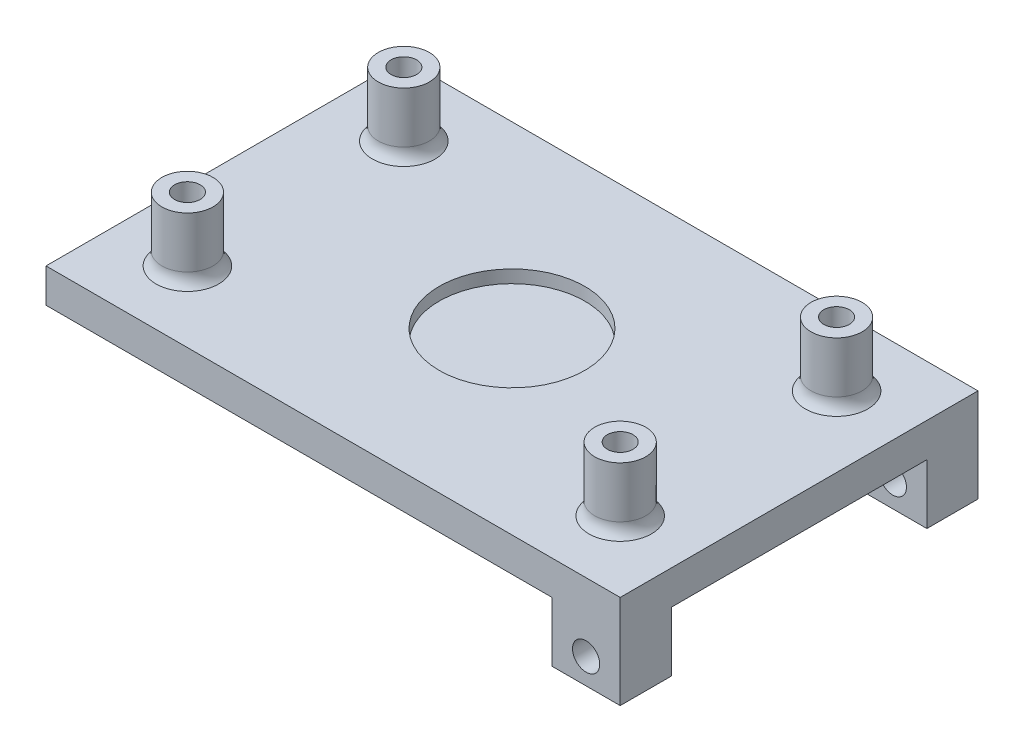
ISO-10303-21;
HEADER;
FILE_DESCRIPTION(('STEP AP214'),'2;1');
FILE_NAME('part.step','',(''),(''),'','','');
FILE_SCHEMA(('AUTOMOTIVE_DESIGN { 1 0 10303 214 1 1 1 1 }'));
ENDSEC;
DATA;
#1=APPLICATION_CONTEXT('core data for automotive mechanical design processes');
#2=APPLICATION_PROTOCOL_DEFINITION('international standard','automotive_design',2000,#1);
#3=PRODUCT_CONTEXT('',#1,'mechanical');
#4=PRODUCT('Part','Part','',(#3));
#5=PRODUCT_RELATED_PRODUCT_CATEGORY('part','',(#4));
#6=PRODUCT_DEFINITION_FORMATION('','',#4);
#7=PRODUCT_DEFINITION_CONTEXT('part definition',#1,'design');
#8=PRODUCT_DEFINITION('design','',#6,#7);
#9=PRODUCT_DEFINITION_SHAPE('','',#8);
#10=(LENGTH_UNIT() NAMED_UNIT(*) SI_UNIT(.MILLI.,.METRE.));
#11=(NAMED_UNIT(*) PLANE_ANGLE_UNIT() SI_UNIT($,.RADIAN.));
#12=(NAMED_UNIT(*) SI_UNIT($,.STERADIAN.) SOLID_ANGLE_UNIT());
#13=UNCERTAINTY_MEASURE_WITH_UNIT(LENGTH_MEASURE(1.E-05),#10,'distance_accuracy_value','');
#14=(GEOMETRIC_REPRESENTATION_CONTEXT(3) GLOBAL_UNCERTAINTY_ASSIGNED_CONTEXT((#13)) GLOBAL_UNIT_ASSIGNED_CONTEXT((#10,
#11,#12)) REPRESENTATION_CONTEXT('',''));
#15=CARTESIAN_POINT('',(0.,0.,0.));
#16=DIRECTION('',(0.,0.,1.));
#17=DIRECTION('',(1.,0.,0.));
#18=AXIS2_PLACEMENT_3D('',#15,#16,#17);
#19=CARTESIAN_POINT('',(63.3999999999999,-8.,-10.));
#20=DIRECTION('',(0.,0.,1.));
#21=DIRECTION('',(1.,0.,0.));
#22=AXIS2_PLACEMENT_3D('',#19,#20,#21);
#23=PLANE('',#22);
#24=CARTESIAN_POINT('',(67.3999999999999,-4.,-9.99999999999999));
#25=DIRECTION('',(0.,0.,-1.));
#26=DIRECTION('',(-1.,0.,0.));
#27=AXIS2_PLACEMENT_3D('',#24,#25,#26);
#28=CIRCLE('',#27,1.60000000000001);
#29=CARTESIAN_POINT('',(65.7999999999999,-4.,-9.99999999999999));
#30=VERTEX_POINT('',#29);
#31=EDGE_CURVE('E165',#30,#30,#28,.T.);
#32=ORIENTED_EDGE('',*,*,#31,.F.);
#33=EDGE_LOOP('',(#32));
#34=FACE_BOUND('',#33,.T.);
#35=DIRECTION('',(1.,0.,0.));
#36=VECTOR('',#35,1.);
#37=CARTESIAN_POINT('',(63.3999999999999,-7.,-10.));
#38=LINE('',#37,#36);
#39=CARTESIAN_POINT('',(63.3999999999999,-7.,-10.));
#40=VERTEX_POINT('',#39);
#41=CARTESIAN_POINT('',(71.3999999999999,-7.,-10.));
#42=VERTEX_POINT('',#41);
#43=EDGE_CURVE('E57',#40,#42,#38,.T.);
#44=ORIENTED_EDGE('',*,*,#43,.F.);
#45=DIRECTION('',(0.,1.,0.));
#46=VECTOR('',#45,1.);
#47=CARTESIAN_POINT('',(63.3999999999999,-8.,-10.));
#48=LINE('',#47,#46);
#49=CARTESIAN_POINT('',(63.3999999999999,0.,-10.));
#50=VERTEX_POINT('',#49);
#51=EDGE_CURVE('E181',#40,#50,#48,.T.);
#52=ORIENTED_EDGE('',*,*,#51,.T.);
#53=DIRECTION('',(1.,0.,0.));
#54=VECTOR('',#53,1.);
#55=CARTESIAN_POINT('',(63.3999999999999,0.,-10.));
#56=LINE('',#55,#54);
#57=CARTESIAN_POINT('',(71.3999999999999,0.,-10.));
#58=VERTEX_POINT('',#57);
#59=EDGE_CURVE('E172',#50,#58,#56,.T.);
#60=ORIENTED_EDGE('',*,*,#59,.T.);
#61=DIRECTION('',(0.,1.,0.));
#62=VECTOR('',#61,1.);
#63=CARTESIAN_POINT('',(71.3999999999999,-8.,-10.));
#64=LINE('',#63,#62);
#65=EDGE_CURVE('E179',#42,#58,#64,.T.);
#66=ORIENTED_EDGE('',*,*,#65,.F.);
#67=EDGE_LOOP('',(#44,#52,#60,#66));
#68=FACE_BOUND('',#67,.T.);
#69=ADVANCED_FACE('F34',(#34,#68),#23,.F.);
#70=CARTESIAN_POINT('',(63.3999999999999,-8.,-46.));
#71=DIRECTION('',(-1.,0.,0.));
#72=DIRECTION('',(0.,0.,1.));
#73=AXIS2_PLACEMENT_3D('',#70,#71,#72);
#74=PLANE('',#73);
#75=DIRECTION('',(0.,1.,0.));
#76=VECTOR('',#75,1.);
#77=CARTESIAN_POINT('',(63.3999999999999,-8.,-46.));
#78=LINE('',#77,#76);
#79=CARTESIAN_POINT('',(63.3999999999999,-7.,-46.));
#80=VERTEX_POINT('',#79);
#81=CARTESIAN_POINT('',(63.3999999999999,0.,-46.));
#82=VERTEX_POINT('',#81);
#83=EDGE_CURVE('E149',#80,#82,#78,.T.);
#84=ORIENTED_EDGE('',*,*,#83,.F.);
#85=DIRECTION('',(0.,0.,-1.));
#86=VECTOR('',#85,1.);
#87=CARTESIAN_POINT('',(63.3999999999999,-7.,-40.));
#88=LINE('',#87,#86);
#89=CARTESIAN_POINT('',(63.3999999999999,-7.,-40.));
#90=VERTEX_POINT('',#89);
#91=EDGE_CURVE('E136',#90,#80,#88,.T.);
#92=ORIENTED_EDGE('',*,*,#91,.F.);
#93=DIRECTION('',(0.,1.,0.));
#94=VECTOR('',#93,1.);
#95=CARTESIAN_POINT('',(63.3999999999999,-8.,-40.));
#96=LINE('',#95,#94);
#97=CARTESIAN_POINT('',(63.3999999999999,0.,-40.));
#98=VERTEX_POINT('',#97);
#99=EDGE_CURVE('E147',#90,#98,#96,.T.);
#100=ORIENTED_EDGE('',*,*,#99,.T.);
#101=DIRECTION('',(0.,0.,1.));
#102=VECTOR('',#101,1.);
#103=CARTESIAN_POINT('',(63.3999999999999,0.,-46.));
#104=LINE('',#103,#102);
#105=EDGE_CURVE('E159',#82,#98,#104,.T.);
#106=ORIENTED_EDGE('',*,*,#105,.F.);
#107=EDGE_LOOP('',(#84,#92,#100,#106));
#108=FACE_BOUND('',#107,.T.);
#109=ADVANCED_FACE('F145',(#108),#74,.T.);
#110=CARTESIAN_POINT('',(63.3999999999999,-8.,-40.));
#111=DIRECTION('',(0.,0.,1.));
#112=DIRECTION('',(1.,0.,0.));
#113=AXIS2_PLACEMENT_3D('',#110,#111,#112);
#114=PLANE('',#113);
#115=CARTESIAN_POINT('',(67.3999999999999,-4.,-40.));
#116=DIRECTION('',(0.,0.,-1.));
#117=DIRECTION('',(-1.,0.,0.));
#118=AXIS2_PLACEMENT_3D('',#115,#116,#117);
#119=CIRCLE('',#118,1.60000000000001);
#120=CARTESIAN_POINT('',(65.7999999999999,-4.,-40.));
#121=VERTEX_POINT('',#120);
#122=EDGE_CURVE('E314',#121,#121,#119,.T.);
#123=ORIENTED_EDGE('',*,*,#122,.T.);
#124=EDGE_LOOP('',(#123));
#125=FACE_BOUND('',#124,.T.);
#126=ORIENTED_EDGE('',*,*,#99,.F.);
#127=DIRECTION('',(-1.,0.,0.));
#128=VECTOR('',#127,1.);
#129=CARTESIAN_POINT('',(71.3999999999999,-7.,-40.));
#130=LINE('',#129,#128);
#131=CARTESIAN_POINT('',(71.3999999999999,-7.,-40.));
#132=VERTEX_POINT('',#131);
#133=EDGE_CURVE('E133',#132,#90,#130,.T.);
#134=ORIENTED_EDGE('',*,*,#133,.F.);
#135=DIRECTION('',(0.,1.,0.));
#136=VECTOR('',#135,1.);
#137=CARTESIAN_POINT('',(71.3999999999999,-8.,-40.));
#138=LINE('',#137,#136);
#139=CARTESIAN_POINT('',(71.3999999999999,0.,-40.));
#140=VERTEX_POINT('',#139);
#141=EDGE_CURVE('E155',#132,#140,#138,.T.);
#142=ORIENTED_EDGE('',*,*,#141,.T.);
#143=DIRECTION('',(1.,0.,0.));
#144=VECTOR('',#143,1.);
#145=CARTESIAN_POINT('',(63.3999999999999,0.,-40.));
#146=LINE('',#145,#144);
#147=EDGE_CURVE('E154',#98,#140,#146,.T.);
#148=ORIENTED_EDGE('',*,*,#147,.F.);
#149=EDGE_LOOP('',(#126,#134,#142,#148));
#150=FACE_BOUND('',#149,.T.);
#151=ADVANCED_FACE('F152',(#125,#150),#114,.T.);
#152=CARTESIAN_POINT('',(63.3999999999999,-8.,-46.));
#153=DIRECTION('',(0.,0.,-1.));
#154=DIRECTION('',(-1.,0.,0.));
#155=AXIS2_PLACEMENT_3D('',#152,#153,#154);
#156=PLANE('',#155);
#157=CARTESIAN_POINT('',(67.3999999999999,-4.,-46.));
#158=DIRECTION('',(0.,0.,-1.));
#159=DIRECTION('',(-1.,0.,0.));
#160=AXIS2_PLACEMENT_3D('',#157,#158,#159);
#161=CIRCLE('',#160,1.60000000000001);
#162=CARTESIAN_POINT('',(65.7999999999999,-4.,-46.));
#163=VERTEX_POINT('',#162);
#164=EDGE_CURVE('E317',#163,#163,#161,.F.);
#165=ORIENTED_EDGE('',*,*,#164,.T.);
#166=EDGE_LOOP('',(#165));
#167=FACE_BOUND('',#166,.T.);
#168=DIRECTION('',(0.,1.,0.));
#169=VECTOR('',#168,1.);
#170=CARTESIAN_POINT('',(71.3999999999999,-8.,-46.));
#171=LINE('',#170,#169);
#172=CARTESIAN_POINT('',(71.3999999999999,-7.,-46.));
#173=VERTEX_POINT('',#172);
#174=CARTESIAN_POINT('',(71.3999999999999,4.,-46.));
#175=VERTEX_POINT('',#174);
#176=EDGE_CURVE('E157',#173,#175,#171,.T.);
#177=ORIENTED_EDGE('',*,*,#176,.F.);
#178=DIRECTION('',(1.,0.,0.));
#179=VECTOR('',#178,1.);
#180=CARTESIAN_POINT('',(63.3999999999999,-7.,-46.));
#181=LINE('',#180,#179);
#182=EDGE_CURVE('E49',#80,#173,#181,.T.);
#183=ORIENTED_EDGE('',*,*,#182,.F.);
#184=ORIENTED_EDGE('',*,*,#83,.T.);
#185=DIRECTION('',(-1.,0.,0.));
#186=VECTOR('',#185,1.);
#187=CARTESIAN_POINT('',(0.,0.,-46.));
#188=LINE('',#187,#186);
#189=CARTESIAN_POINT('',(4.,0.,-46.));
#190=VERTEX_POINT('',#189);
#191=EDGE_CURVE('E298',#82,#190,#188,.T.);
#192=ORIENTED_EDGE('',*,*,#191,.T.);
#193=DIRECTION('',(0.,-1.,0.));
#194=VECTOR('',#193,1.);
#195=CARTESIAN_POINT('',(4.,8.,-46.));
#196=LINE('',#195,#194);
#197=CARTESIAN_POINT('',(4.,4.,-46.));
#198=VERTEX_POINT('',#197);
#199=EDGE_CURVE('E296',#198,#190,#196,.T.);
#200=ORIENTED_EDGE('',*,*,#199,.F.);
#201=DIRECTION('',(-1.,0.,0.));
#202=VECTOR('',#201,1.);
#203=CARTESIAN_POINT('',(0.,4.,-46.));
#204=LINE('',#203,#202);
#205=EDGE_CURVE('E11',#175,#198,#204,.T.);
#206=ORIENTED_EDGE('',*,*,#205,.F.);
#207=EDGE_LOOP('',(#177,#183,#184,#192,#200,#206));
#208=FACE_BOUND('',#207,.T.);
#209=ADVANCED_FACE('F294',(#167,#208),#156,.T.);
#210=CARTESIAN_POINT('',(63.3999999999999,-8.,-4.));
#211=DIRECTION('',(1.,0.,0.));
#212=DIRECTION('',(0.,0.,-1.));
#213=AXIS2_PLACEMENT_3D('',#210,#211,#212);
#214=PLANE('',#213);
#215=DIRECTION('',(0.,0.,-1.));
#216=VECTOR('',#215,1.);
#217=CARTESIAN_POINT('',(63.3999999999999,-7.,-4.));
#218=LINE('',#217,#216);
#219=CARTESIAN_POINT('',(63.3999999999999,-7.,-4.));
#220=VERTEX_POINT('',#219);
#221=EDGE_CURVE('E335',#220,#40,#218,.T.);
#222=ORIENTED_EDGE('',*,*,#221,.F.);
#223=DIRECTION('',(0.,1.,0.));
#224=VECTOR('',#223,1.);
#225=CARTESIAN_POINT('',(63.3999999999999,-8.,-4.));
#226=LINE('',#225,#224);
#227=CARTESIAN_POINT('',(63.3999999999999,0.,-4.));
#228=VERTEX_POINT('',#227);
#229=EDGE_CURVE('E175',#220,#228,#226,.T.);
#230=ORIENTED_EDGE('',*,*,#229,.T.);
#231=DIRECTION('',(0.,0.,-1.));
#232=VECTOR('',#231,1.);
#233=CARTESIAN_POINT('',(63.3999999999999,0.,-4.));
#234=LINE('',#233,#232);
#235=EDGE_CURVE('E169',#228,#50,#234,.T.);
#236=ORIENTED_EDGE('',*,*,#235,.T.);
#237=ORIENTED_EDGE('',*,*,#51,.F.);
#238=EDGE_LOOP('',(#222,#230,#236,#237));
#239=FACE_BOUND('',#238,.T.);
#240=ADVANCED_FACE('F347',(#239),#214,.F.);
#241=CARTESIAN_POINT('',(63.3999999999999,-8.,-4.));
#242=DIRECTION('',(0.,0.,-1.));
#243=DIRECTION('',(-1.,0.,0.));
#244=AXIS2_PLACEMENT_3D('',#241,#242,#243);
#245=PLANE('',#244);
#246=CARTESIAN_POINT('',(67.3999999999999,-4.,-4.));
#247=DIRECTION('',(0.,0.,-1.));
#248=DIRECTION('',(-1.,0.,0.));
#249=AXIS2_PLACEMENT_3D('',#246,#247,#248);
#250=CIRCLE('',#249,1.60000000000001);
#251=CARTESIAN_POINT('',(65.7999999999999,-4.,-4.));
#252=VERTEX_POINT('',#251);
#253=EDGE_CURVE('E168',#252,#252,#250,.T.);
#254=ORIENTED_EDGE('',*,*,#253,.T.);
#255=EDGE_LOOP('',(#254));
#256=FACE_BOUND('',#255,.T.);
#257=DIRECTION('',(-1.,0.,0.));
#258=VECTOR('',#257,1.);
#259=CARTESIAN_POINT('',(71.3999999999999,-7.,-4.));
#260=LINE('',#259,#258);
#261=CARTESIAN_POINT('',(71.3999999999999,-7.,-4.));
#262=VERTEX_POINT('',#261);
#263=EDGE_CURVE('E337',#262,#220,#260,.T.);
#264=ORIENTED_EDGE('',*,*,#263,.F.);
#265=DIRECTION('',(0.,1.,0.));
#266=VECTOR('',#265,1.);
#267=CARTESIAN_POINT('',(71.3999999999999,-8.,-4.));
#268=LINE('',#267,#266);
#269=CARTESIAN_POINT('',(71.3999999999999,4.,-4.));
#270=VERTEX_POINT('',#269);
#271=EDGE_CURVE('E177',#262,#270,#268,.T.);
#272=ORIENTED_EDGE('',*,*,#271,.T.);
#273=DIRECTION('',(-1.,0.,0.));
#274=VECTOR('',#273,1.);
#275=CARTESIAN_POINT('',(0.,4.,-4.));
#276=LINE('',#275,#274);
#277=CARTESIAN_POINT('',(4.,4.,-4.));
#278=VERTEX_POINT('',#277);
#279=EDGE_CURVE('E280',#270,#278,#276,.T.);
#280=ORIENTED_EDGE('',*,*,#279,.T.);
#281=DIRECTION('',(0.,-1.,0.));
#282=VECTOR('',#281,1.);
#283=CARTESIAN_POINT('',(4.,8.,-4.));
#284=LINE('',#283,#282);
#285=CARTESIAN_POINT('',(4.,0.,-4.));
#286=VERTEX_POINT('',#285);
#287=EDGE_CURVE('E302',#278,#286,#284,.T.);
#288=ORIENTED_EDGE('',*,*,#287,.T.);
#289=DIRECTION('',(-1.,0.,0.));
#290=VECTOR('',#289,1.);
#291=CARTESIAN_POINT('',(0.,0.,-4.));
#292=LINE('',#291,#290);
#293=EDGE_CURVE('E326',#228,#286,#292,.T.);
#294=ORIENTED_EDGE('',*,*,#293,.F.);
#295=ORIENTED_EDGE('',*,*,#229,.F.);
#296=EDGE_LOOP('',(#264,#272,#280,#288,#294,#295));
#297=FACE_BOUND('',#296,.T.);
#298=ADVANCED_FACE('F349',(#256,#297),#245,.F.);
#299=CARTESIAN_POINT('',(71.3999999999999,-8.,-4.));
#300=DIRECTION('',(-1.,0.,0.));
#301=DIRECTION('',(0.,0.,1.));
#302=AXIS2_PLACEMENT_3D('',#299,#300,#301);
#303=PLANE('',#302);
#304=DIRECTION('',(0.,0.,1.));
#305=VECTOR('',#304,1.);
#306=CARTESIAN_POINT('',(71.3999999999999,-7.,-46.));
#307=LINE('',#306,#305);
#308=EDGE_CURVE('E137',#173,#132,#307,.T.);
#309=ORIENTED_EDGE('',*,*,#308,.F.);
#310=ORIENTED_EDGE('',*,*,#176,.T.);
#311=DIRECTION('',(0.,0.,-1.));
#312=VECTOR('',#311,1.);
#313=CARTESIAN_POINT('',(71.3999999999999,4.,0.));
#314=LINE('',#313,#312);
#315=EDGE_CURVE('E42',#270,#175,#314,.T.);
#316=ORIENTED_EDGE('',*,*,#315,.F.);
#317=ORIENTED_EDGE('',*,*,#271,.F.);
#318=DIRECTION('',(0.,0.,1.));
#319=VECTOR('',#318,1.);
#320=CARTESIAN_POINT('',(71.3999999999999,-7.,-10.));
#321=LINE('',#320,#319);
#322=EDGE_CURVE('E141',#42,#262,#321,.T.);
#323=ORIENTED_EDGE('',*,*,#322,.F.);
#324=ORIENTED_EDGE('',*,*,#65,.T.);
#325=DIRECTION('',(0.,0.,-1.));
#326=VECTOR('',#325,1.);
#327=CARTESIAN_POINT('',(71.3999999999999,0.,0.));
#328=LINE('',#327,#326);
#329=EDGE_CURVE('E324',#58,#140,#328,.T.);
#330=ORIENTED_EDGE('',*,*,#329,.T.);
#331=ORIENTED_EDGE('',*,*,#141,.F.);
#332=EDGE_LOOP('',(#309,#310,#316,#317,#323,#324,#330,#331));
#333=FACE_BOUND('',#332,.T.);
#334=ADVANCED_FACE('F290',(#333),#303,.F.);
#335=CARTESIAN_POINT('',(0.,4.,0.));
#336=DIRECTION('',(0.,-1.,0.));
#337=DIRECTION('',(0.,0.,-1.));
#338=AXIS2_PLACEMENT_3D('',#335,#336,#337);
#339=PLANE('',#338);
#340=CARTESIAN_POINT('',(12.2999999999999,4.,-12.3));
#341=DIRECTION('',(0.,1.,0.));
#342=DIRECTION('',(0.,0.,1.));
#343=AXIS2_PLACEMENT_3D('',#340,#341,#342);
#344=CIRCLE('',#343,3.67712434446771);
#345=CARTESIAN_POINT('',(12.2999999999999,4.,-8.6228756555323));
#346=VERTEX_POINT('',#345);
#347=EDGE_CURVE('E220',#346,#346,#344,.F.);
#348=ORIENTED_EDGE('',*,*,#347,.T.);
#349=EDGE_LOOP('',(#348));
#350=FACE_BOUND('',#349,.T.);
#351=CARTESIAN_POINT('',(12.2999999999999,4.,-37.7));
#352=DIRECTION('',(0.,1.,0.));
#353=DIRECTION('',(0.,0.,1.));
#354=AXIS2_PLACEMENT_3D('',#351,#352,#353);
#355=CIRCLE('',#354,3.67712434446771);
#356=CARTESIAN_POINT('',(12.2999999999999,4.,-34.0228756555323));
#357=VERTEX_POINT('',#356);
#358=EDGE_CURVE('E216',#357,#357,#355,.F.);
#359=ORIENTED_EDGE('',*,*,#358,.T.);
#360=EDGE_LOOP('',(#359));
#361=FACE_BOUND('',#360,.T.);
#362=CARTESIAN_POINT('',(63.1,4.,-37.7));
#363=DIRECTION('',(0.,1.,0.));
#364=DIRECTION('',(0.,0.,1.));
#365=AXIS2_PLACEMENT_3D('',#362,#363,#364);
#366=CIRCLE('',#365,3.67712434446771);
#367=CARTESIAN_POINT('',(63.1,4.,-34.0228756555323));
#368=VERTEX_POINT('',#367);
#369=EDGE_CURVE('E219',#368,#368,#366,.F.);
#370=ORIENTED_EDGE('',*,*,#369,.T.);
#371=EDGE_LOOP('',(#370));
#372=FACE_BOUND('',#371,.T.);
#373=CARTESIAN_POINT('',(63.1,4.,-12.3));
#374=DIRECTION('',(0.,1.,0.));
#375=DIRECTION('',(0.,0.,1.));
#376=AXIS2_PLACEMENT_3D('',#373,#374,#375);
#377=CIRCLE('',#376,3.67712434446771);
#378=CARTESIAN_POINT('',(63.1,4.,-8.6228756555323));
#379=VERTEX_POINT('',#378);
#380=EDGE_CURVE('E223',#379,#379,#377,.F.);
#381=ORIENTED_EDGE('',*,*,#380,.T.);
#382=EDGE_LOOP('',(#381));
#383=FACE_BOUND('',#382,.T.);
#384=CARTESIAN_POINT('',(37.7,4.,-25.));
#385=DIRECTION('',(0.,1.,0.));
#386=DIRECTION('',(0.,0.,1.));
#387=AXIS2_PLACEMENT_3D('',#384,#385,#386);
#388=CIRCLE('',#387,8.55);
#389=CARTESIAN_POINT('',(37.7,4.,-16.45));
#390=VERTEX_POINT('',#389);
#391=EDGE_CURVE('E207',#390,#390,#388,.T.);
#392=ORIENTED_EDGE('',*,*,#391,.F.);
#393=EDGE_LOOP('',(#392));
#394=FACE_BOUND('',#393,.T.);
#395=DIRECTION('',(0.,0.,-1.));
#396=VECTOR('',#395,1.);
#397=CARTESIAN_POINT('',(4.,4.,0.));
#398=LINE('',#397,#396);
#399=EDGE_CURVE('E312',#278,#198,#398,.T.);
#400=ORIENTED_EDGE('',*,*,#399,.F.);
#401=ORIENTED_EDGE('',*,*,#279,.F.);
#402=ORIENTED_EDGE('',*,*,#315,.T.);
#403=ORIENTED_EDGE('',*,*,#205,.T.);
#404=EDGE_LOOP('',(#400,#401,#402,#403));
#405=FACE_BOUND('',#404,.T.);
#406=ADVANCED_FACE('F286',(#350,#361,#372,#383,#394,#405),#339,.F.);
#407=CARTESIAN_POINT('',(12.2999999999999,-0.5,-37.7));
#408=DIRECTION('',(0.,1.,0.));
#409=DIRECTION('',(0.,0.,1.));
#410=AXIS2_PLACEMENT_3D('',#407,#408,#409);
#411=CYLINDRICAL_SURFACE('',#410,1.5);
#412=CARTESIAN_POINT('',(12.2999999999999,11.5,-37.7));
#413=DIRECTION('',(0.,1.,0.));
#414=DIRECTION('',(0.,0.,1.));
#415=AXIS2_PLACEMENT_3D('',#412,#413,#414);
#416=CIRCLE('',#415,1.5);
#417=CARTESIAN_POINT('',(12.2999999999999,11.5,-36.2));
#418=VERTEX_POINT('',#417);
#419=EDGE_CURVE('E256',#418,#418,#416,.T.);
#420=ORIENTED_EDGE('',*,*,#419,.T.);
#421=EDGE_LOOP('',(#420));
#422=FACE_BOUND('',#421,.T.);
#423=CARTESIAN_POINT('',(12.2999999999999,4.,-37.7));
#424=DIRECTION('',(0.,-1.,0.));
#425=DIRECTION('',(0.,0.,-1.));
#426=AXIS2_PLACEMENT_3D('',#423,#424,#425);
#427=CIRCLE('',#426,1.5);
#428=CARTESIAN_POINT('',(12.2999999999999,4.,-39.2));
#429=VERTEX_POINT('',#428);
#430=EDGE_CURVE('E235',#429,#429,#427,.F.);
#431=ORIENTED_EDGE('',*,*,#430,.F.);
#432=EDGE_LOOP('',(#431));
#433=FACE_BOUND('',#432,.T.);
#434=ADVANCED_FACE('F406',(#422,#433),#411,.F.);
#435=CARTESIAN_POINT('',(12.2999999999999,5.5,-37.7));
#436=DIRECTION('',(0.,-1.,0.));
#437=DIRECTION('',(0.,0.,-1.));
#438=AXIS2_PLACEMENT_3D('',#435,#436,#437);
#439=TOROIDAL_SURFACE('',#438,5.,2.);
#440=CARTESIAN_POINT('',(12.2999999999999,5.5,-37.7));
#441=DIRECTION('',(0.,-1.,0.));
#442=DIRECTION('',(0.,0.,-1.));
#443=AXIS2_PLACEMENT_3D('',#440,#441,#442);
#444=CIRCLE('',#443,3.);
#445=CARTESIAN_POINT('',(12.2999999999999,5.5,-40.7));
#446=VERTEX_POINT('',#445);
#447=EDGE_CURVE('E268',#446,#446,#444,.F.);
#448=ORIENTED_EDGE('',*,*,#447,.F.);
#449=EDGE_LOOP('',(#448));
#450=FACE_BOUND('',#449,.T.);
#451=ORIENTED_EDGE('',*,*,#358,.F.);
#452=EDGE_LOOP('',(#451));
#453=FACE_BOUND('',#452,.T.);
#454=ADVANCED_FACE('F443',(#450,#453),#439,.F.);
#455=CARTESIAN_POINT('',(12.2999999999999,11.5,-37.7));
#456=DIRECTION('',(0.,1.,0.));
#457=DIRECTION('',(0.,0.,1.));
#458=AXIS2_PLACEMENT_3D('',#455,#456,#457);
#459=PLANE('',#458);
#460=CARTESIAN_POINT('',(12.2999999999999,11.5,-37.7));
#461=DIRECTION('',(0.,1.,0.));
#462=DIRECTION('',(0.,0.,1.));
#463=AXIS2_PLACEMENT_3D('',#460,#461,#462);
#464=CIRCLE('',#463,3.);
#465=CARTESIAN_POINT('',(12.2999999999999,11.5,-34.7));
#466=VERTEX_POINT('',#465);
#467=EDGE_CURVE('E259',#466,#466,#464,.T.);
#468=ORIENTED_EDGE('',*,*,#467,.T.);
#469=EDGE_LOOP('',(#468));
#470=FACE_BOUND('',#469,.T.);
#471=ORIENTED_EDGE('',*,*,#419,.F.);
#472=EDGE_LOOP('',(#471));
#473=FACE_BOUND('',#472,.T.);
#474=ADVANCED_FACE('F440',(#470,#473),#459,.T.);
#475=CARTESIAN_POINT('',(12.2999999999999,11.5,-37.7));
#476=DIRECTION('',(0.,-1.,0.));
#477=DIRECTION('',(0.,0.,-1.));
#478=AXIS2_PLACEMENT_3D('',#475,#476,#477);
#479=CYLINDRICAL_SURFACE('',#478,3.);
#480=ORIENTED_EDGE('',*,*,#447,.T.);
#481=EDGE_LOOP('',(#480));
#482=FACE_BOUND('',#481,.T.);
#483=ORIENTED_EDGE('',*,*,#467,.F.);
#484=EDGE_LOOP('',(#483));
#485=FACE_BOUND('',#484,.T.);
#486=ADVANCED_FACE('F438',(#482,#485),#479,.T.);
#487=CARTESIAN_POINT('',(12.2999999999999,11.5,-12.3));
#488=DIRECTION('',(0.,-1.,0.));
#489=DIRECTION('',(0.,0.,-1.));
#490=AXIS2_PLACEMENT_3D('',#487,#488,#489);
#491=CYLINDRICAL_SURFACE('',#490,3.);
#492=CARTESIAN_POINT('',(12.2999999999999,5.5,-12.3));
#493=DIRECTION('',(0.,-1.,0.));
#494=DIRECTION('',(0.,0.,-1.));
#495=AXIS2_PLACEMENT_3D('',#492,#493,#494);
#496=CIRCLE('',#495,3.);
#497=CARTESIAN_POINT('',(12.2999999999999,5.5,-15.3));
#498=VERTEX_POINT('',#497);
#499=EDGE_CURVE('E271',#498,#498,#496,.F.);
#500=ORIENTED_EDGE('',*,*,#499,.T.);
#501=EDGE_LOOP('',(#500));
#502=FACE_BOUND('',#501,.T.);
#503=CARTESIAN_POINT('',(12.2999999999999,11.5,-12.3));
#504=DIRECTION('',(0.,-1.,0.));
#505=DIRECTION('',(0.,0.,-1.));
#506=AXIS2_PLACEMENT_3D('',#503,#504,#505);
#507=CIRCLE('',#506,3.);
#508=CARTESIAN_POINT('',(12.2999999999999,11.5,-15.3));
#509=VERTEX_POINT('',#508);
#510=EDGE_CURVE('E253',#509,#509,#507,.T.);
#511=ORIENTED_EDGE('',*,*,#510,.T.);
#512=EDGE_LOOP('',(#511));
#513=FACE_BOUND('',#512,.T.);
#514=ADVANCED_FACE('F435',(#502,#513),#491,.T.);
#515=CARTESIAN_POINT('',(12.2999999999999,5.5,-12.3));
#516=DIRECTION('',(0.,-1.,0.));
#517=DIRECTION('',(0.,0.,-1.));
#518=AXIS2_PLACEMENT_3D('',#515,#516,#517);
#519=TOROIDAL_SURFACE('',#518,5.,2.);
#520=ORIENTED_EDGE('',*,*,#499,.F.);
#521=EDGE_LOOP('',(#520));
#522=FACE_BOUND('',#521,.T.);
#523=ORIENTED_EDGE('',*,*,#347,.F.);
#524=EDGE_LOOP('',(#523));
#525=FACE_BOUND('',#524,.T.);
#526=ADVANCED_FACE('F36',(#522,#525),#519,.F.);
#527=CARTESIAN_POINT('',(12.2999999999999,11.5,-12.3));
#528=DIRECTION('',(0.,1.,0.));
#529=DIRECTION('',(0.,0.,-1.));
#530=AXIS2_PLACEMENT_3D('',#527,#528,#529);
#531=PLANE('',#530);
#532=CARTESIAN_POINT('',(12.2999999999999,11.5,-12.3));
#533=DIRECTION('',(0.,-1.,0.));
#534=DIRECTION('',(0.,0.,-1.));
#535=AXIS2_PLACEMENT_3D('',#532,#533,#534);
#536=CIRCLE('',#535,1.5);
#537=CARTESIAN_POINT('',(12.2999999999999,11.5,-13.8));
#538=VERTEX_POINT('',#537);
#539=EDGE_CURVE('E250',#538,#538,#536,.T.);
#540=ORIENTED_EDGE('',*,*,#539,.T.);
#541=EDGE_LOOP('',(#540));
#542=FACE_BOUND('',#541,.T.);
#543=ORIENTED_EDGE('',*,*,#510,.F.);
#544=EDGE_LOOP('',(#543));
#545=FACE_BOUND('',#544,.T.);
#546=ADVANCED_FACE('F431',(#542,#545),#531,.T.);
#547=CARTESIAN_POINT('',(12.2999999999999,-0.5,-12.3));
#548=DIRECTION('',(0.,1.,0.));
#549=DIRECTION('',(0.,0.,1.));
#550=AXIS2_PLACEMENT_3D('',#547,#548,#549);
#551=CYLINDRICAL_SURFACE('',#550,1.5);
#552=ORIENTED_EDGE('',*,*,#539,.F.);
#553=EDGE_LOOP('',(#552));
#554=FACE_BOUND('',#553,.T.);
#555=CARTESIAN_POINT('',(12.2999999999999,4.,-12.3));
#556=DIRECTION('',(0.,-1.,0.));
#557=DIRECTION('',(0.,0.,-1.));
#558=AXIS2_PLACEMENT_3D('',#555,#556,#557);
#559=CIRCLE('',#558,1.5);
#560=CARTESIAN_POINT('',(12.2999999999999,4.,-13.8));
#561=VERTEX_POINT('',#560);
#562=EDGE_CURVE('E226',#561,#561,#559,.F.);
#563=ORIENTED_EDGE('',*,*,#562,.F.);
#564=EDGE_LOOP('',(#563));
#565=FACE_BOUND('',#564,.T.);
#566=ADVANCED_FACE('F419',(#554,#565),#551,.F.);
#567=CARTESIAN_POINT('',(63.1,11.5,-37.7));
#568=DIRECTION('',(0.,-1.,0.));
#569=DIRECTION('',(0.,0.,-1.));
#570=AXIS2_PLACEMENT_3D('',#567,#568,#569);
#571=CYLINDRICAL_SURFACE('',#570,3.);
#572=CARTESIAN_POINT('',(63.1,5.5,-37.7));
#573=DIRECTION('',(0.,-1.,0.));
#574=DIRECTION('',(0.,0.,-1.));
#575=AXIS2_PLACEMENT_3D('',#572,#573,#574);
#576=CIRCLE('',#575,3.);
#577=CARTESIAN_POINT('',(63.1,5.5,-40.7));
#578=VERTEX_POINT('',#577);
#579=EDGE_CURVE('E265',#578,#578,#576,.F.);
#580=ORIENTED_EDGE('',*,*,#579,.T.);
#581=EDGE_LOOP('',(#580));
#582=FACE_BOUND('',#581,.T.);
#583=CARTESIAN_POINT('',(63.1,11.5,-37.7));
#584=DIRECTION('',(0.,-1.,0.));
#585=DIRECTION('',(0.,0.,1.));
#586=AXIS2_PLACEMENT_3D('',#583,#584,#585);
#587=CIRCLE('',#586,3.);
#588=CARTESIAN_POINT('',(63.1,11.5,-34.7));
#589=VERTEX_POINT('',#588);
#590=EDGE_CURVE('E241',#589,#589,#587,.T.);
#591=ORIENTED_EDGE('',*,*,#590,.T.);
#592=EDGE_LOOP('',(#591));
#593=FACE_BOUND('',#592,.T.);
#594=ADVANCED_FACE('F416',(#582,#593),#571,.T.);
#595=CARTESIAN_POINT('',(63.1,5.5,-37.7));
#596=DIRECTION('',(0.,-1.,0.));
#597=DIRECTION('',(0.,0.,-1.));
#598=AXIS2_PLACEMENT_3D('',#595,#596,#597);
#599=TOROIDAL_SURFACE('',#598,5.,2.);
#600=ORIENTED_EDGE('',*,*,#579,.F.);
#601=EDGE_LOOP('',(#600));
#602=FACE_BOUND('',#601,.T.);
#603=ORIENTED_EDGE('',*,*,#369,.F.);
#604=EDGE_LOOP('',(#603));
#605=FACE_BOUND('',#604,.T.);
#606=ADVANCED_FACE('F414',(#602,#605),#599,.F.);
#607=CARTESIAN_POINT('',(63.1,11.5,-37.7));
#608=DIRECTION('',(0.,1.,0.));
#609=DIRECTION('',(0.,0.,1.));
#610=AXIS2_PLACEMENT_3D('',#607,#608,#609);
#611=PLANE('',#610);
#612=CARTESIAN_POINT('',(63.1,11.5,-37.7));
#613=DIRECTION('',(0.,-1.,0.));
#614=DIRECTION('',(0.,0.,1.));
#615=AXIS2_PLACEMENT_3D('',#612,#613,#614);
#616=CIRCLE('',#615,1.5);
#617=CARTESIAN_POINT('',(63.1,11.5,-36.2));
#618=VERTEX_POINT('',#617);
#619=EDGE_CURVE('E213',#618,#618,#616,.T.);
#620=ORIENTED_EDGE('',*,*,#619,.T.);
#621=EDGE_LOOP('',(#620));
#622=FACE_BOUND('',#621,.T.);
#623=ORIENTED_EDGE('',*,*,#590,.F.);
#624=EDGE_LOOP('',(#623));
#625=FACE_BOUND('',#624,.T.);
#626=ADVANCED_FACE('F410',(#622,#625),#611,.T.);
#627=CARTESIAN_POINT('',(63.0999999999999,-0.5,-37.7));
#628=DIRECTION('',(0.,1.,0.));
#629=DIRECTION('',(0.,0.,1.));
#630=AXIS2_PLACEMENT_3D('',#627,#628,#629);
#631=CYLINDRICAL_SURFACE('',#630,1.5);
#632=ORIENTED_EDGE('',*,*,#619,.F.);
#633=EDGE_LOOP('',(#632));
#634=FACE_BOUND('',#633,.T.);
#635=CARTESIAN_POINT('',(63.0999999999999,4.,-37.7));
#636=DIRECTION('',(0.,-1.,0.));
#637=DIRECTION('',(0.,0.,-1.));
#638=AXIS2_PLACEMENT_3D('',#635,#636,#637);
#639=CIRCLE('',#638,1.5);
#640=CARTESIAN_POINT('',(63.0999999999999,4.,-39.2));
#641=VERTEX_POINT('',#640);
#642=EDGE_CURVE('E229',#641,#641,#639,.F.);
#643=ORIENTED_EDGE('',*,*,#642,.F.);
#644=EDGE_LOOP('',(#643));
#645=FACE_BOUND('',#644,.T.);
#646=ADVANCED_FACE('F413',(#634,#645),#631,.F.);
#647=CARTESIAN_POINT('',(63.1,11.5,-12.3));
#648=DIRECTION('',(0.,-1.,0.));
#649=DIRECTION('',(0.,0.,-1.));
#650=AXIS2_PLACEMENT_3D('',#647,#648,#649);
#651=CYLINDRICAL_SURFACE('',#650,3.);
#652=CARTESIAN_POINT('',(63.1,5.5,-12.3));
#653=DIRECTION('',(0.,-1.,0.));
#654=DIRECTION('',(0.,0.,-1.));
#655=AXIS2_PLACEMENT_3D('',#652,#653,#654);
#656=CIRCLE('',#655,3.);
#657=CARTESIAN_POINT('',(63.1,5.5,-15.3));
#658=VERTEX_POINT('',#657);
#659=EDGE_CURVE('E262',#658,#658,#656,.F.);
#660=ORIENTED_EDGE('',*,*,#659,.T.);
#661=EDGE_LOOP('',(#660));
#662=FACE_BOUND('',#661,.T.);
#663=CARTESIAN_POINT('',(63.1,11.5,-12.3));
#664=DIRECTION('',(0.,1.,0.));
#665=DIRECTION('',(0.,0.,-1.));
#666=AXIS2_PLACEMENT_3D('',#663,#664,#665);
#667=CIRCLE('',#666,3.);
#668=CARTESIAN_POINT('',(63.1,11.5,-15.3));
#669=VERTEX_POINT('',#668);
#670=EDGE_CURVE('E247',#669,#669,#667,.T.);
#671=ORIENTED_EDGE('',*,*,#670,.F.);
#672=EDGE_LOOP('',(#671));
#673=FACE_BOUND('',#672,.T.);
#674=ADVANCED_FACE('F427',(#662,#673),#651,.T.);
#675=CARTESIAN_POINT('',(63.1,5.5,-12.3));
#676=DIRECTION('',(0.,-1.,0.));
#677=DIRECTION('',(0.,0.,-1.));
#678=AXIS2_PLACEMENT_3D('',#675,#676,#677);
#679=TOROIDAL_SURFACE('',#678,5.,2.);
#680=ORIENTED_EDGE('',*,*,#659,.F.);
#681=EDGE_LOOP('',(#680));
#682=FACE_BOUND('',#681,.T.);
#683=ORIENTED_EDGE('',*,*,#380,.F.);
#684=EDGE_LOOP('',(#683));
#685=FACE_BOUND('',#684,.T.);
#686=ADVANCED_FACE('F425',(#682,#685),#679,.F.);
#687=CARTESIAN_POINT('',(63.1,11.5,-12.3));
#688=DIRECTION('',(0.,1.,0.));
#689=DIRECTION('',(0.,0.,-1.));
#690=AXIS2_PLACEMENT_3D('',#687,#688,#689);
#691=PLANE('',#690);
#692=ORIENTED_EDGE('',*,*,#670,.T.);
#693=EDGE_LOOP('',(#692));
#694=FACE_BOUND('',#693,.T.);
#695=CARTESIAN_POINT('',(63.1,11.5,-12.3));
#696=DIRECTION('',(0.,1.,0.));
#697=DIRECTION('',(0.,0.,-1.));
#698=AXIS2_PLACEMENT_3D('',#695,#696,#697);
#699=CIRCLE('',#698,1.5);
#700=CARTESIAN_POINT('',(63.1,11.5,-13.8));
#701=VERTEX_POINT('',#700);
#702=EDGE_CURVE('E244',#701,#701,#699,.T.);
#703=ORIENTED_EDGE('',*,*,#702,.F.);
#704=EDGE_LOOP('',(#703));
#705=FACE_BOUND('',#704,.T.);
#706=ADVANCED_FACE('F421',(#694,#705),#691,.T.);
#707=CARTESIAN_POINT('',(63.0999999999999,-0.5,-12.3));
#708=DIRECTION('',(0.,1.,0.));
#709=DIRECTION('',(0.,0.,1.));
#710=AXIS2_PLACEMENT_3D('',#707,#708,#709);
#711=CYLINDRICAL_SURFACE('',#710,1.5);
#712=ORIENTED_EDGE('',*,*,#702,.T.);
#713=EDGE_LOOP('',(#712));
#714=FACE_BOUND('',#713,.T.);
#715=CARTESIAN_POINT('',(63.0999999999999,4.,-12.3));
#716=DIRECTION('',(0.,-1.,0.));
#717=DIRECTION('',(0.,0.,-1.));
#718=AXIS2_PLACEMENT_3D('',#715,#716,#717);
#719=CIRCLE('',#718,1.5);
#720=CARTESIAN_POINT('',(63.0999999999999,4.,-13.8));
#721=VERTEX_POINT('',#720);
#722=EDGE_CURVE('E232',#721,#721,#719,.F.);
#723=ORIENTED_EDGE('',*,*,#722,.F.);
#724=EDGE_LOOP('',(#723));
#725=FACE_BOUND('',#724,.T.);
#726=ADVANCED_FACE('F424',(#714,#725),#711,.F.);
#727=ORIENTED_EDGE('',*,*,#562,.T.);
#728=EDGE_LOOP('',(#727));
#729=FACE_BOUND('',#728,.T.);
#730=ADVANCED_FACE('F409',(#729),#339,.F.);
#731=ORIENTED_EDGE('',*,*,#642,.T.);
#732=EDGE_LOOP('',(#731));
#733=FACE_BOUND('',#732,.T.);
#734=ADVANCED_FACE('F493',(#733),#339,.F.);
#735=ORIENTED_EDGE('',*,*,#722,.T.);
#736=EDGE_LOOP('',(#735));
#737=FACE_BOUND('',#736,.T.);
#738=ADVANCED_FACE('F408',(#737),#339,.F.);
#739=ORIENTED_EDGE('',*,*,#430,.T.);
#740=EDGE_LOOP('',(#739));
#741=FACE_BOUND('',#740,.T.);
#742=ADVANCED_FACE('F402',(#741),#339,.F.);
#743=CARTESIAN_POINT('',(37.7,2.5,-25.));
#744=DIRECTION('',(0.,1.,0.));
#745=DIRECTION('',(0.,0.,1.));
#746=AXIS2_PLACEMENT_3D('',#743,#744,#745);
#747=CYLINDRICAL_SURFACE('',#746,8.55);
#748=CARTESIAN_POINT('',(37.7,2.5,-25.));
#749=DIRECTION('',(0.,1.,0.));
#750=DIRECTION('',(0.,0.,1.));
#751=AXIS2_PLACEMENT_3D('',#748,#749,#750);
#752=CIRCLE('',#751,8.55);
#753=CARTESIAN_POINT('',(37.7,2.5,-16.45));
#754=VERTEX_POINT('',#753);
#755=EDGE_CURVE('E210',#754,#754,#752,.T.);
#756=ORIENTED_EDGE('',*,*,#755,.F.);
#757=EDGE_LOOP('',(#756));
#758=FACE_BOUND('',#757,.T.);
#759=ORIENTED_EDGE('',*,*,#391,.T.);
#760=EDGE_LOOP('',(#759));
#761=FACE_BOUND('',#760,.T.);
#762=ADVANCED_FACE('F398',(#758,#761),#747,.F.);
#763=CARTESIAN_POINT('',(37.7,2.5,-25.));
#764=DIRECTION('',(0.,1.,0.));
#765=DIRECTION('',(0.,0.,1.));
#766=AXIS2_PLACEMENT_3D('',#763,#764,#765);
#767=PLANE('',#766);
#768=ORIENTED_EDGE('',*,*,#755,.T.);
#769=EDGE_LOOP('',(#768));
#770=FACE_BOUND('',#769,.T.);
#771=ADVANCED_FACE('F395',(#770),#767,.T.);
#772=CARTESIAN_POINT('',(4.,8.,0.));
#773=DIRECTION('',(-1.,0.,0.));
#774=DIRECTION('',(0.,0.,1.));
#775=AXIS2_PLACEMENT_3D('',#772,#773,#774);
#776=PLANE('',#775);
#777=ORIENTED_EDGE('',*,*,#399,.T.);
#778=ORIENTED_EDGE('',*,*,#199,.T.);
#779=DIRECTION('',(0.,0.,-1.));
#780=VECTOR('',#779,1.);
#781=CARTESIAN_POINT('',(4.,0.,0.));
#782=LINE('',#781,#780);
#783=CARTESIAN_POINT('',(4.,0.,-27.5));
#784=VERTEX_POINT('',#783);
#785=EDGE_CURVE('E323',#784,#190,#782,.T.);
#786=ORIENTED_EDGE('',*,*,#785,.F.);
#787=DIRECTION('',(0.,1.,0.));
#788=VECTOR('',#787,1.);
#789=CARTESIAN_POINT('',(4.,1.87,-27.5));
#790=LINE('',#789,#788);
#791=CARTESIAN_POINT('',(4.,1.87,-27.5));
#792=VERTEX_POINT('',#791);
#793=EDGE_CURVE('E305',#784,#792,#790,.T.);
#794=ORIENTED_EDGE('',*,*,#793,.T.);
#795=DIRECTION('',(0.,0.,-1.));
#796=VECTOR('',#795,1.);
#797=CARTESIAN_POINT('',(4.,1.87,-25.));
#798=LINE('',#797,#796);
#799=CARTESIAN_POINT('',(4.,1.87,-22.5));
#800=VERTEX_POINT('',#799);
#801=EDGE_CURVE('E301',#800,#792,#798,.T.);
#802=ORIENTED_EDGE('',*,*,#801,.F.);
#803=DIRECTION('',(0.,1.,0.));
#804=VECTOR('',#803,1.);
#805=CARTESIAN_POINT('',(4.,1.87,-22.5));
#806=LINE('',#805,#804);
#807=CARTESIAN_POINT('',(4.,0.,-22.5));
#808=VERTEX_POINT('',#807);
#809=EDGE_CURVE('E238',#808,#800,#806,.T.);
#810=ORIENTED_EDGE('',*,*,#809,.F.);
#811=EDGE_CURVE('E328',#286,#808,#782,.T.);
#812=ORIENTED_EDGE('',*,*,#811,.F.);
#813=ORIENTED_EDGE('',*,*,#287,.F.);
#814=EDGE_LOOP('',(#777,#778,#786,#794,#802,#810,#812,#813));
#815=FACE_BOUND('',#814,.T.);
#816=ADVANCED_FACE('F383',(#815),#776,.T.);
#817=CARTESIAN_POINT('',(17.6997479970282,2.37,-25.));
#818=DIRECTION('',(0.,-1.,0.));
#819=DIRECTION('',(0.,0.,-1.));
#820=AXIS2_PLACEMENT_3D('',#817,#818,#819);
#821=PLANE('',#820);
#822=CARTESIAN_POINT('',(17.6997479970282,2.37,-25.));
#823=DIRECTION('',(0.,-1.,0.));
#824=DIRECTION('',(0.,0.,-1.));
#825=AXIS2_PLACEMENT_3D('',#822,#823,#824);
#826=CIRCLE('',#825,4.);
#827=CARTESIAN_POINT('',(17.6997479970282,2.37,-29.));
#828=VERTEX_POINT('',#827);
#829=EDGE_CURVE('E198',#828,#828,#826,.T.);
#830=ORIENTED_EDGE('',*,*,#829,.T.);
#831=EDGE_LOOP('',(#830));
#832=FACE_BOUND('',#831,.T.);
#833=ADVANCED_FACE('F379',(#832),#821,.T.);
#834=CARTESIAN_POINT('',(17.6997479970282,2.37,-25.));
#835=DIRECTION('',(0.,-1.,0.));
#836=DIRECTION('',(0.,0.,-1.));
#837=AXIS2_PLACEMENT_3D('',#834,#835,#836);
#838=CYLINDRICAL_SURFACE('',#837,4.);
#839=ORIENTED_EDGE('',*,*,#829,.F.);
#840=EDGE_LOOP('',(#839));
#841=FACE_BOUND('',#840,.T.);
#842=CARTESIAN_POINT('',(17.6997479970282,1.87,-25.));
#843=DIRECTION('',(0.,-1.,0.));
#844=DIRECTION('',(0.,0.,-1.));
#845=AXIS2_PLACEMENT_3D('',#842,#843,#844);
#846=CIRCLE('',#845,4.);
#847=CARTESIAN_POINT('',(17.6997479970282,1.87,-29.));
#848=VERTEX_POINT('',#847);
#849=EDGE_CURVE('E195',#848,#848,#846,.T.);
#850=ORIENTED_EDGE('',*,*,#849,.T.);
#851=EDGE_LOOP('',(#850));
#852=FACE_BOUND('',#851,.T.);
#853=ADVANCED_FACE('F382',(#841,#852),#838,.F.);
#854=CARTESIAN_POINT('',(17.6997479970282,1.87,-25.));
#855=DIRECTION('',(0.,-1.,0.));
#856=DIRECTION('',(0.,0.,-1.));
#857=AXIS2_PLACEMENT_3D('',#854,#855,#856);
#858=CYLINDRICAL_SURFACE('',#857,4.85);
#859=CARTESIAN_POINT('',(17.6997479970282,1.87,-25.));
#860=DIRECTION('',(0.,-1.,0.));
#861=DIRECTION('',(0.,0.,-1.));
#862=AXIS2_PLACEMENT_3D('',#859,#860,#861);
#863=CIRCLE('',#862,4.85);
#864=CARTESIAN_POINT('',(13.543728266565,1.87,-27.5));
#865=VERTEX_POINT('',#864);
#866=CARTESIAN_POINT('',(13.543728266565,1.87,-22.5));
#867=VERTEX_POINT('',#866);
#868=EDGE_CURVE('E204',#865,#867,#863,.T.);
#869=ORIENTED_EDGE('',*,*,#868,.F.);
#870=DIRECTION('',(0.,-1.,0.));
#871=VECTOR('',#870,1.);
#872=CARTESIAN_POINT('',(13.543728266565,1.87,-27.5));
#873=LINE('',#872,#871);
#874=CARTESIAN_POINT('',(13.543728266565,0.,-27.5));
#875=VERTEX_POINT('',#874);
#876=EDGE_CURVE('E192',#865,#875,#873,.T.);
#877=ORIENTED_EDGE('',*,*,#876,.T.);
#878=CARTESIAN_POINT('',(17.6997479970282,0.,-25.));
#879=DIRECTION('',(0.,-1.,0.));
#880=DIRECTION('',(0.,0.,-1.));
#881=AXIS2_PLACEMENT_3D('',#878,#879,#880);
#882=CIRCLE('',#881,4.85);
#883=CARTESIAN_POINT('',(13.543728266565,0.,-22.5));
#884=VERTEX_POINT('',#883);
#885=EDGE_CURVE('E201',#875,#884,#882,.T.);
#886=ORIENTED_EDGE('',*,*,#885,.T.);
#887=DIRECTION('',(0.,-1.,0.));
#888=VECTOR('',#887,1.);
#889=CARTESIAN_POINT('',(13.543728266565,1.87,-22.5));
#890=LINE('',#889,#888);
#891=EDGE_CURVE('E189',#867,#884,#890,.T.);
#892=ORIENTED_EDGE('',*,*,#891,.F.);
#893=EDGE_LOOP('',(#869,#877,#886,#892));
#894=FACE_BOUND('',#893,.T.);
#895=ADVANCED_FACE('F387',(#894),#858,.F.);
#896=CARTESIAN_POINT('',(67.3999999999999,-4.,-48.));
#897=DIRECTION('',(0.,0.,1.));
#898=DIRECTION('',(1.,0.,0.));
#899=AXIS2_PLACEMENT_3D('',#896,#897,#898);
#900=CYLINDRICAL_SURFACE('',#899,1.60000000000001);
#901=ORIENTED_EDGE('',*,*,#164,.F.);
#902=EDGE_LOOP('',(#901));
#903=FACE_BOUND('',#902,.T.);
#904=ORIENTED_EDGE('',*,*,#122,.F.);
#905=EDGE_LOOP('',(#904));
#906=FACE_BOUND('',#905,.T.);
#907=ADVANCED_FACE('F373',(#903,#906),#900,.F.);
#908=CARTESIAN_POINT('',(0.,1.87,-27.5));
#909=DIRECTION('',(0.,0.,-1.));
#910=DIRECTION('',(-1.,0.,0.));
#911=AXIS2_PLACEMENT_3D('',#908,#909,#910);
#912=PLANE('',#911);
#913=ORIENTED_EDGE('',*,*,#793,.F.);
#914=DIRECTION('',(1.,0.,0.));
#915=VECTOR('',#914,1.);
#916=CARTESIAN_POINT('',(0.,0.,-27.5));
#917=LINE('',#916,#915);
#918=EDGE_CURVE('E187',#784,#875,#917,.T.);
#919=ORIENTED_EDGE('',*,*,#918,.T.);
#920=ORIENTED_EDGE('',*,*,#876,.F.);
#921=DIRECTION('',(1.,0.,0.));
#922=VECTOR('',#921,1.);
#923=CARTESIAN_POINT('',(0.,1.87,-27.5));
#924=LINE('',#923,#922);
#925=EDGE_CURVE('E186',#792,#865,#924,.T.);
#926=ORIENTED_EDGE('',*,*,#925,.F.);
#927=EDGE_LOOP('',(#913,#919,#920,#926));
#928=FACE_BOUND('',#927,.T.);
#929=ADVANCED_FACE('F369',(#928),#912,.F.);
#930=CARTESIAN_POINT('',(0.,1.87,-22.5));
#931=DIRECTION('',(0.,0.,-1.));
#932=DIRECTION('',(-1.,0.,0.));
#933=AXIS2_PLACEMENT_3D('',#930,#931,#932);
#934=PLANE('',#933);
#935=DIRECTION('',(1.,0.,0.));
#936=VECTOR('',#935,1.);
#937=CARTESIAN_POINT('',(0.,0.,-22.5));
#938=LINE('',#937,#936);
#939=EDGE_CURVE('E183',#808,#884,#938,.T.);
#940=ORIENTED_EDGE('',*,*,#939,.F.);
#941=ORIENTED_EDGE('',*,*,#809,.T.);
#942=DIRECTION('',(1.,0.,0.));
#943=VECTOR('',#942,1.);
#944=CARTESIAN_POINT('',(0.,1.87,-22.5));
#945=LINE('',#944,#943);
#946=EDGE_CURVE('E184',#800,#867,#945,.T.);
#947=ORIENTED_EDGE('',*,*,#946,.T.);
#948=ORIENTED_EDGE('',*,*,#891,.T.);
#949=EDGE_LOOP('',(#940,#941,#947,#948));
#950=FACE_BOUND('',#949,.T.);
#951=ADVANCED_FACE('F372',(#950),#934,.T.);
#952=CARTESIAN_POINT('',(17.6997479970282,1.87,-25.));
#953=DIRECTION('',(0.,-1.,0.));
#954=DIRECTION('',(0.,0.,-1.));
#955=AXIS2_PLACEMENT_3D('',#952,#953,#954);
#956=PLANE('',#955);
#957=ORIENTED_EDGE('',*,*,#849,.F.);
#958=EDGE_LOOP('',(#957));
#959=FACE_BOUND('',#958,.T.);
#960=ORIENTED_EDGE('',*,*,#946,.F.);
#961=ORIENTED_EDGE('',*,*,#801,.T.);
#962=ORIENTED_EDGE('',*,*,#925,.T.);
#963=ORIENTED_EDGE('',*,*,#868,.T.);
#964=EDGE_LOOP('',(#960,#961,#962,#963));
#965=FACE_BOUND('',#964,.T.);
#966=ADVANCED_FACE('F377',(#959,#965),#956,.T.);
#967=CARTESIAN_POINT('',(0.,0.,0.));
#968=DIRECTION('',(0.,-1.,0.));
#969=DIRECTION('',(0.,0.,-1.));
#970=AXIS2_PLACEMENT_3D('',#967,#968,#969);
#971=PLANE('',#970);
#972=ORIENTED_EDGE('',*,*,#918,.F.);
#973=ORIENTED_EDGE('',*,*,#785,.T.);
#974=ORIENTED_EDGE('',*,*,#191,.F.);
#975=ORIENTED_EDGE('',*,*,#105,.T.);
#976=ORIENTED_EDGE('',*,*,#147,.T.);
#977=ORIENTED_EDGE('',*,*,#329,.F.);
#978=ORIENTED_EDGE('',*,*,#59,.F.);
#979=ORIENTED_EDGE('',*,*,#235,.F.);
#980=ORIENTED_EDGE('',*,*,#293,.T.);
#981=ORIENTED_EDGE('',*,*,#811,.T.);
#982=ORIENTED_EDGE('',*,*,#939,.T.);
#983=ORIENTED_EDGE('',*,*,#885,.F.);
#984=EDGE_LOOP('',(#972,#973,#974,#975,#976,#977,#978,#979,#980,#981,#982,#983));
#985=FACE_BOUND('',#984,.T.);
#986=ADVANCED_FACE('F321',(#985),#971,.T.);
#987=CARTESIAN_POINT('',(67.3999999999999,-4.,-1.99999999999999));
#988=DIRECTION('',(0.,0.,-1.));
#989=DIRECTION('',(-1.,0.,0.));
#990=AXIS2_PLACEMENT_3D('',#987,#988,#989);
#991=CYLINDRICAL_SURFACE('',#990,1.60000000000001);
#992=ORIENTED_EDGE('',*,*,#31,.T.);
#993=EDGE_LOOP('',(#992));
#994=FACE_BOUND('',#993,.T.);
#995=ORIENTED_EDGE('',*,*,#253,.F.);
#996=EDGE_LOOP('',(#995));
#997=FACE_BOUND('',#996,.T.);
#998=ADVANCED_FACE('F462',(#994,#997),#991,.F.);
#999=CARTESIAN_POINT('',(0.,-7.,0.));
#1000=DIRECTION('',(0.,-1.,0.));
#1001=DIRECTION('',(0.,0.,-1.));
#1002=AXIS2_PLACEMENT_3D('',#999,#1000,#1001);
#1003=PLANE('',#1002);
#1004=ORIENTED_EDGE('',*,*,#263,.T.);
#1005=ORIENTED_EDGE('',*,*,#221,.T.);
#1006=ORIENTED_EDGE('',*,*,#43,.T.);
#1007=ORIENTED_EDGE('',*,*,#322,.T.);
#1008=EDGE_LOOP('',(#1004,#1005,#1006,#1007));
#1009=FACE_BOUND('',#1008,.T.);
#1010=ADVANCED_FACE('F342',(#1009),#1003,.T.);
#1011=CARTESIAN_POINT('',(0.,-7.,0.));
#1012=DIRECTION('',(0.,-1.,0.));
#1013=DIRECTION('',(0.,0.,-1.));
#1014=AXIS2_PLACEMENT_3D('',#1011,#1012,#1013);
#1015=PLANE('',#1014);
#1016=ORIENTED_EDGE('',*,*,#133,.T.);
#1017=ORIENTED_EDGE('',*,*,#91,.T.);
#1018=ORIENTED_EDGE('',*,*,#182,.T.);
#1019=ORIENTED_EDGE('',*,*,#308,.T.);
#1020=EDGE_LOOP('',(#1016,#1017,#1018,#1019));
#1021=FACE_BOUND('',#1020,.T.);
#1022=ADVANCED_FACE('F135',(#1021),#1015,.T.);
#1023=CLOSED_SHELL('',(#69,#109,#151,#209,#240,#298,#334,#406,#434,#454,#474,#486,#514,#526,
#546,#566,#594,#606,#626,#646,#674,#686,#706,#726,#730,#734,#738,#742,#762,#771,#816,#833,#853,
#895,#907,#929,#951,#966,#986,#998,#1010,#1022));
#1024=MANIFOLD_SOLID_BREP('B2',#1023);
#1025=ADVANCED_BREP_SHAPE_REPRESENTATION('',(#18,#1024),#14);
#1026=SHAPE_DEFINITION_REPRESENTATION(#9,#1025);
ENDSEC;
END-ISO-10303-21;
